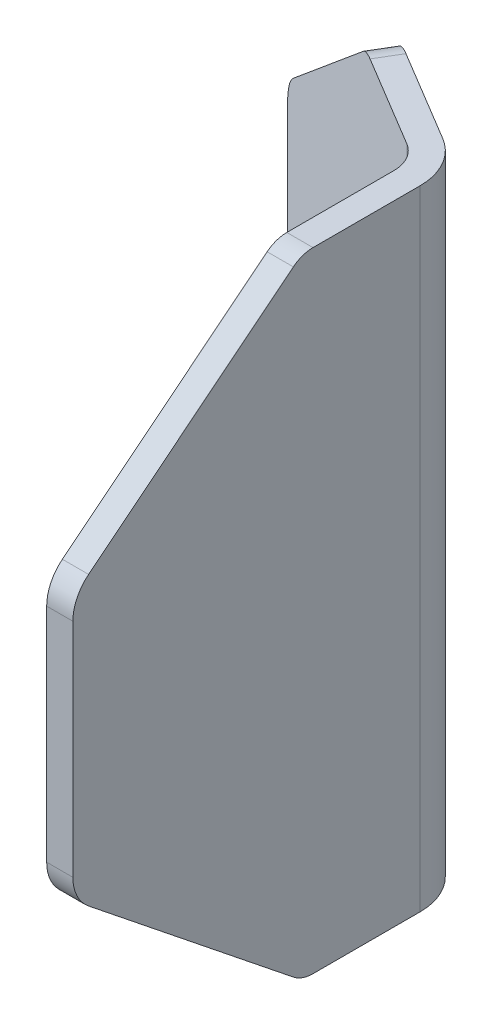
ISO-10303-21;
HEADER;
FILE_DESCRIPTION(('STEP AP214'),'2;1');
FILE_NAME('part.step','',(''),(''),'','','');
FILE_SCHEMA(('AUTOMOTIVE_DESIGN { 1 0 10303 214 1 1 1 1 }'));
ENDSEC;
DATA;
#1=APPLICATION_CONTEXT('core data for automotive mechanical design processes');
#2=APPLICATION_PROTOCOL_DEFINITION('international standard','automotive_design',2000,#1);
#3=PRODUCT_CONTEXT('',#1,'mechanical');
#4=PRODUCT('Part','Part','',(#3));
#5=PRODUCT_RELATED_PRODUCT_CATEGORY('part','',(#4));
#6=PRODUCT_DEFINITION_FORMATION('','',#4);
#7=PRODUCT_DEFINITION_CONTEXT('part definition',#1,'design');
#8=PRODUCT_DEFINITION('design','',#6,#7);
#9=PRODUCT_DEFINITION_SHAPE('','',#8);
#10=(LENGTH_UNIT() NAMED_UNIT(*) SI_UNIT(.MILLI.,.METRE.));
#11=(NAMED_UNIT(*) PLANE_ANGLE_UNIT() SI_UNIT($,.RADIAN.));
#12=(NAMED_UNIT(*) SI_UNIT($,.STERADIAN.) SOLID_ANGLE_UNIT());
#13=UNCERTAINTY_MEASURE_WITH_UNIT(LENGTH_MEASURE(1.E-05),#10,'distance_accuracy_value','');
#14=(GEOMETRIC_REPRESENTATION_CONTEXT(3) GLOBAL_UNCERTAINTY_ASSIGNED_CONTEXT((#13)) GLOBAL_UNIT_ASSIGNED_CONTEXT((#10,
#11,#12)) REPRESENTATION_CONTEXT('',''));
#15=CARTESIAN_POINT('',(0.,0.,0.));
#16=DIRECTION('',(0.,0.,1.));
#17=DIRECTION('',(1.,0.,0.));
#18=AXIS2_PLACEMENT_3D('',#15,#16,#17);
#19=CARTESIAN_POINT('',(-3.175,76.2,46.2534));
#20=DIRECTION('',(1.,0.,0.));
#21=DIRECTION('',(0.,0.,-1.));
#22=AXIS2_PLACEMENT_3D('',#19,#20,#21);
#23=PLANE('',#22);
#24=DIRECTION('',(0.,0.,1.));
#25=VECTOR('',#24,1.);
#26=CARTESIAN_POINT('',(-3.175,0.,46.2534));
#27=LINE('',#26,#25);
#28=CARTESIAN_POINT('',(-3.175,0.,4.17182452403423));
#29=VERTEX_POINT('',#28);
#30=CARTESIAN_POINT('',(-3.175,0.,17.1570723718987));
#31=VERTEX_POINT('',#30);
#32=EDGE_CURVE('E209',#29,#31,#27,.T.);
#33=ORIENTED_EDGE('',*,*,#32,.T.);
#34=CARTESIAN_POINT('',(-3.175,3.81,17.1570723718987));
#35=DIRECTION('',(1.,0.,0.));
#36=DIRECTION('',(0.,0.,-1.));
#37=AXIS2_PLACEMENT_3D('',#34,#35,#36);
#38=CIRCLE('',#37,3.81);
#39=CARTESIAN_POINT('',(-3.175,0.835819703262759,19.5383223718987));
#40=VERTEX_POINT('',#39);
#41=EDGE_CURVE('E289',#31,#40,#38,.F.);
#42=ORIENTED_EDGE('',*,*,#41,.T.);
#43=DIRECTION('',(0.,0.625,0.7806247497998));
#44=VECTOR('',#43,1.);
#45=CARTESIAN_POINT('',(-3.175,22.225,46.2534));
#46=LINE('',#45,#44);
#47=CARTESIAN_POINT('',(-3.175,20.6997793350065,44.3484));
#48=VERTEX_POINT('',#47);
#49=EDGE_CURVE('E352',#40,#48,#46,.T.);
#50=ORIENTED_EDGE('',*,*,#49,.T.);
#51=CARTESIAN_POINT('',(-3.175,24.6653530639895,41.1734));
#52=DIRECTION('',(1.,0.,0.));
#53=DIRECTION('',(0.,0.,-1.));
#54=AXIS2_PLACEMENT_3D('',#51,#52,#53);
#55=CIRCLE('',#54,5.08);
#56=CARTESIAN_POINT('',(-3.175,24.6653530639895,46.2534));
#57=VERTEX_POINT('',#56);
#58=EDGE_CURVE('E270',#48,#57,#55,.F.);
#59=ORIENTED_EDGE('',*,*,#58,.T.);
#60=DIRECTION('',(0.,-1.,0.));
#61=VECTOR('',#60,1.);
#62=CARTESIAN_POINT('',(-3.175,76.2,46.2534));
#63=LINE('',#62,#61);
#64=CARTESIAN_POINT('',(-3.175,51.5346469360105,46.2534));
#65=VERTEX_POINT('',#64);
#66=EDGE_CURVE('E229',#65,#57,#63,.T.);
#67=ORIENTED_EDGE('',*,*,#66,.F.);
#68=CARTESIAN_POINT('',(-3.175,51.5346469360105,41.1734));
#69=DIRECTION('',(1.,0.,0.));
#70=DIRECTION('',(0.,0.,-1.));
#71=AXIS2_PLACEMENT_3D('',#68,#69,#70);
#72=CIRCLE('',#71,5.08);
#73=CARTESIAN_POINT('',(-3.175,55.5002206649935,44.3484));
#74=VERTEX_POINT('',#73);
#75=EDGE_CURVE('E267',#65,#74,#72,.F.);
#76=ORIENTED_EDGE('',*,*,#75,.T.);
#77=DIRECTION('',(0.,-0.625000000000001,0.7806247497998));
#78=VECTOR('',#77,1.);
#79=CARTESIAN_POINT('',(-3.175,53.975,46.2534));
#80=LINE('',#79,#78);
#81=CARTESIAN_POINT('',(-3.175,75.3641802967372,19.5383223718987));
#82=VERTEX_POINT('',#81);
#83=EDGE_CURVE('E308',#82,#74,#80,.T.);
#84=ORIENTED_EDGE('',*,*,#83,.F.);
#85=CARTESIAN_POINT('',(-3.175,72.39,17.1570723718987));
#86=DIRECTION('',(1.,0.,0.));
#87=DIRECTION('',(0.,0.,-1.));
#88=AXIS2_PLACEMENT_3D('',#85,#86,#87);
#89=CIRCLE('',#88,3.81);
#90=CARTESIAN_POINT('',(-3.175,76.2,17.1570723718987));
#91=VERTEX_POINT('',#90);
#92=EDGE_CURVE('E287',#82,#91,#89,.F.);
#93=ORIENTED_EDGE('',*,*,#92,.T.);
#94=DIRECTION('',(0.,0.,1.));
#95=VECTOR('',#94,1.);
#96=CARTESIAN_POINT('',(-3.175,76.2,46.2534));
#97=LINE('',#96,#95);
#98=CARTESIAN_POINT('',(-3.175,76.2,4.17182452403423));
#99=VERTEX_POINT('',#98);
#100=EDGE_CURVE('E193',#99,#91,#97,.T.);
#101=ORIENTED_EDGE('',*,*,#100,.F.);
#102=DIRECTION('',(0.,-1.,0.));
#103=VECTOR('',#102,1.);
#104=CARTESIAN_POINT('',(-3.175,76.2,4.17182452403423));
#105=LINE('',#104,#103);
#106=EDGE_CURVE('E188',#99,#29,#105,.T.);
#107=ORIENTED_EDGE('',*,*,#106,.T.);
#108=EDGE_LOOP('',(#33,#42,#50,#59,#67,#76,#84,#93,#101,#107));
#109=FACE_BOUND('',#108,.T.);
#110=ADVANCED_FACE('F34',(#109),#23,.F.);
#111=CARTESIAN_POINT('',(-3.175,76.2,46.2534));
#112=DIRECTION('',(0.,0.,-1.));
#113=DIRECTION('',(-1.,0.,0.));
#114=AXIS2_PLACEMENT_3D('',#111,#112,#113);
#115=PLANE('',#114);
#116=ORIENTED_EDGE('',*,*,#66,.T.);
#117=DIRECTION('',(1.,0.,0.));
#118=VECTOR('',#117,1.);
#119=CARTESIAN_POINT('',(0.,24.6653530639895,46.2534));
#120=LINE('',#119,#118);
#121=CARTESIAN_POINT('',(0.,24.6653530639895,46.2534));
#122=VERTEX_POINT('',#121);
#123=EDGE_CURVE('E257',#57,#122,#120,.T.);
#124=ORIENTED_EDGE('',*,*,#123,.T.);
#125=DIRECTION('',(0.,-1.,0.));
#126=VECTOR('',#125,1.);
#127=CARTESIAN_POINT('',(0.,76.2,46.2534));
#128=LINE('',#127,#126);
#129=CARTESIAN_POINT('',(0.,51.5346469360105,46.2534));
#130=VERTEX_POINT('',#129);
#131=EDGE_CURVE('E226',#130,#122,#128,.T.);
#132=ORIENTED_EDGE('',*,*,#131,.F.);
#133=DIRECTION('',(1.,0.,0.));
#134=VECTOR('',#133,1.);
#135=CARTESIAN_POINT('',(-3.175,51.5346469360105,46.2534));
#136=LINE('',#135,#134);
#137=EDGE_CURVE('E255',#130,#65,#136,.F.);
#138=ORIENTED_EDGE('',*,*,#137,.T.);
#139=EDGE_LOOP('',(#116,#124,#132,#138));
#140=FACE_BOUND('',#139,.T.);
#141=ADVANCED_FACE('F364',(#140),#115,.F.);
#142=CARTESIAN_POINT('',(0.,76.2,46.2534));
#143=DIRECTION('',(-1.,0.,0.));
#144=DIRECTION('',(0.,0.,1.));
#145=AXIS2_PLACEMENT_3D('',#142,#143,#144);
#146=PLANE('',#145);
#147=DIRECTION('',(0.,-0.625,-0.7806247497998));
#148=VECTOR('',#147,1.);
#149=CARTESIAN_POINT('',(0.,22.225,46.2534));
#150=LINE('',#149,#148);
#151=CARTESIAN_POINT('',(0.,20.6997793350065,44.3484));
#152=VERTEX_POINT('',#151);
#153=CARTESIAN_POINT('',(0.,0.835819703262762,19.5383223718987));
#154=VERTEX_POINT('',#153);
#155=EDGE_CURVE('E207',#152,#154,#150,.T.);
#156=ORIENTED_EDGE('',*,*,#155,.T.);
#157=CARTESIAN_POINT('',(0.,3.81,17.1570723718987));
#158=DIRECTION('',(-1.,0.,0.));
#159=DIRECTION('',(0.,0.,1.));
#160=AXIS2_PLACEMENT_3D('',#157,#158,#159);
#161=CIRCLE('',#160,3.81);
#162=CARTESIAN_POINT('',(0.,0.,17.1570723718987));
#163=VERTEX_POINT('',#162);
#164=EDGE_CURVE('E280',#154,#163,#161,.F.);
#165=ORIENTED_EDGE('',*,*,#164,.T.);
#166=DIRECTION('',(0.,0.,-1.));
#167=VECTOR('',#166,1.);
#168=CARTESIAN_POINT('',(0.,0.,46.2534));
#169=LINE('',#168,#167);
#170=CARTESIAN_POINT('',(0.,0.,4.17182452403425));
#171=VERTEX_POINT('',#170);
#172=EDGE_CURVE('E212',#163,#171,#169,.T.);
#173=ORIENTED_EDGE('',*,*,#172,.T.);
#174=DIRECTION('',(0.,-1.,0.));
#175=VECTOR('',#174,1.);
#176=CARTESIAN_POINT('',(0.,76.2,4.17182452403425));
#177=LINE('',#176,#175);
#178=CARTESIAN_POINT('',(0.,76.2,4.17182452403425));
#179=VERTEX_POINT('',#178);
#180=EDGE_CURVE('E223',#179,#171,#177,.T.);
#181=ORIENTED_EDGE('',*,*,#180,.F.);
#182=DIRECTION('',(0.,0.,-1.));
#183=VECTOR('',#182,1.);
#184=CARTESIAN_POINT('',(0.,76.2,46.2534));
#185=LINE('',#184,#183);
#186=CARTESIAN_POINT('',(0.,76.2,17.1570723718987));
#187=VERTEX_POINT('',#186);
#188=EDGE_CURVE('E195',#187,#179,#185,.T.);
#189=ORIENTED_EDGE('',*,*,#188,.F.);
#190=CARTESIAN_POINT('',(0.,72.39,17.1570723718987));
#191=DIRECTION('',(-1.,0.,0.));
#192=DIRECTION('',(0.,0.,1.));
#193=AXIS2_PLACEMENT_3D('',#190,#191,#192);
#194=CIRCLE('',#193,3.81);
#195=CARTESIAN_POINT('',(0.,75.3641802967372,19.5383223718987));
#196=VERTEX_POINT('',#195);
#197=EDGE_CURVE('E278',#187,#196,#194,.F.);
#198=ORIENTED_EDGE('',*,*,#197,.T.);
#199=DIRECTION('',(0.,0.625000000000001,-0.780624749799799));
#200=VECTOR('',#199,1.);
#201=CARTESIAN_POINT('',(0.,53.975,46.2534));
#202=LINE('',#201,#200);
#203=CARTESIAN_POINT('',(0.,55.5002206649935,44.3484));
#204=VERTEX_POINT('',#203);
#205=EDGE_CURVE('E310',#204,#196,#202,.T.);
#206=ORIENTED_EDGE('',*,*,#205,.F.);
#207=CARTESIAN_POINT('',(0.,51.5346469360105,41.1734));
#208=DIRECTION('',(-1.,0.,0.));
#209=DIRECTION('',(0.,0.,1.));
#210=AXIS2_PLACEMENT_3D('',#207,#208,#209);
#211=CIRCLE('',#210,5.08);
#212=EDGE_CURVE('E260',#204,#130,#211,.F.);
#213=ORIENTED_EDGE('',*,*,#212,.T.);
#214=ORIENTED_EDGE('',*,*,#131,.T.);
#215=CARTESIAN_POINT('',(0.,24.6653530639895,41.1734));
#216=DIRECTION('',(-1.,0.,0.));
#217=DIRECTION('',(0.,0.,1.));
#218=AXIS2_PLACEMENT_3D('',#215,#216,#217);
#219=CIRCLE('',#218,5.08);
#220=EDGE_CURVE('E262',#122,#152,#219,.F.);
#221=ORIENTED_EDGE('',*,*,#220,.T.);
#222=EDGE_LOOP('',(#156,#165,#173,#181,#189,#198,#206,#213,#214,#221));
#223=FACE_BOUND('',#222,.T.);
#224=ADVANCED_FACE('F325',(#223),#146,.F.);
#225=CARTESIAN_POINT('',(-7.366,0.,4.17182452403421));
#226=DIRECTION('',(0.,-1.,0.));
#227=DIRECTION('',(0.,0.,-1.));
#228=AXIS2_PLACEMENT_3D('',#225,#226,#227);
#229=PLANE('',#228);
#230=ORIENTED_EDGE('',*,*,#172,.F.);
#231=DIRECTION('',(1.,0.,0.));
#232=VECTOR('',#231,1.);
#233=CARTESIAN_POINT('',(-7.366,0.,17.1570723718987));
#234=LINE('',#233,#232);
#235=EDGE_CURVE('E285',#163,#31,#234,.F.);
#236=ORIENTED_EDGE('',*,*,#235,.T.);
#237=ORIENTED_EDGE('',*,*,#32,.F.);
#238=CARTESIAN_POINT('',(-7.366,0.,4.17182452403421));
#239=DIRECTION('',(0.,-1.,0.));
#240=DIRECTION('',(0.,0.,-1.));
#241=AXIS2_PLACEMENT_3D('',#238,#239,#240);
#242=CIRCLE('',#241,4.191);
#243=CARTESIAN_POINT('',(-5.21068388037329,0.,0.577510483152802));
#244=VERTEX_POINT('',#243);
#245=EDGE_CURVE('E206',#244,#29,#242,.T.);
#246=ORIENTED_EDGE('',*,*,#245,.F.);
#247=DIRECTION('',(0.857626829129421,0.,0.514272517209909));
#248=VECTOR('',#247,1.);
#249=CARTESIAN_POINT('',(-41.3009720205962,0.,-21.0638872650309));
#250=LINE('',#249,#248);
#251=CARTESIAN_POINT('',(-16.3471808175969,0.,-6.100445614163));
#252=VERTEX_POINT('',#251);
#253=EDGE_CURVE('E184',#252,#244,#250,.T.);
#254=ORIENTED_EDGE('',*,*,#253,.F.);
#255=DIRECTION('',(0.514272517209909,0.,-0.85762682912942));
#256=VECTOR('',#255,1.);
#257=CARTESIAN_POINT('',(-14.7143655754555,0.,-8.82341079664892));
#258=LINE('',#257,#256);
#259=CARTESIAN_POINT('',(-14.7143655754555,0.,-8.82341079664891));
#260=VERTEX_POINT('',#259);
#261=EDGE_CURVE('E282',#252,#260,#258,.T.);
#262=ORIENTED_EDGE('',*,*,#261,.T.);
#263=DIRECTION('',(-0.857626829129421,0.,-0.514272517209909));
#264=VECTOR('',#263,1.);
#265=CARTESIAN_POINT('',(-39.6681567784547,0.,-23.7868524475168));
#266=LINE('',#265,#264);
#267=CARTESIAN_POINT('',(-3.57786863823183,0.,-2.1454546993331));
#268=VERTEX_POINT('',#267);
#269=EDGE_CURVE('E177',#268,#260,#266,.T.);
#270=ORIENTED_EDGE('',*,*,#269,.F.);
#271=CARTESIAN_POINT('',(-7.366,0.,4.17182452403421));
#272=DIRECTION('',(0.,1.,0.));
#273=DIRECTION('',(0.,0.,-1.));
#274=AXIS2_PLACEMENT_3D('',#271,#272,#273);
#275=CIRCLE('',#274,7.366);
#276=EDGE_CURVE('E214',#171,#268,#275,.T.);
#277=ORIENTED_EDGE('',*,*,#276,.F.);
#278=EDGE_LOOP('',(#230,#236,#237,#246,#254,#262,#270,#277));
#279=FACE_BOUND('',#278,.T.);
#280=ADVANCED_FACE('F396',(#279),#229,.T.);
#281=CARTESIAN_POINT('',(-39.6681567784547,76.2,-23.7868524475168));
#282=DIRECTION('',(0.85762682912942,0.,0.514272517209909));
#283=DIRECTION('',(0.514272517209909,0.,-0.85762682912942));
#284=AXIS2_PLACEMENT_3D('',#281,#282,#283);
#285=PLANE('',#284);
#286=DIRECTION('',(0.,-1.,0.));
#287=VECTOR('',#286,1.);
#288=CARTESIAN_POINT('',(-39.6681567784547,76.2,-23.7868524475168));
#289=LINE('',#288,#287);
#290=CARTESIAN_POINT('',(-39.6681567784547,51.5346469360105,-23.7868524475168));
#291=VERTEX_POINT('',#290);
#292=CARTESIAN_POINT('',(-39.6681567784547,24.6653530639895,-23.7868524475168));
#293=VERTEX_POINT('',#292);
#294=EDGE_CURVE('E204',#291,#293,#289,.T.);
#295=ORIENTED_EDGE('',*,*,#294,.T.);
#296=DIRECTION('',(0.514272517209909,0.,-0.85762682912942));
#297=VECTOR('',#296,1.);
#298=CARTESIAN_POINT('',(-39.6681567784547,24.6653530639895,-23.7868524475168));
#299=LINE('',#298,#297);
#300=CARTESIAN_POINT('',(-41.3009720205962,24.6653530639895,-21.0638872650309));
#301=VERTEX_POINT('',#300);
#302=EDGE_CURVE('E246',#293,#301,#299,.F.);
#303=ORIENTED_EDGE('',*,*,#302,.T.);
#304=DIRECTION('',(0.,-1.,0.));
#305=VECTOR('',#304,1.);
#306=CARTESIAN_POINT('',(-41.3009720205962,76.2,-21.0638872650309));
#307=LINE('',#306,#305);
#308=CARTESIAN_POINT('',(-41.3009720205962,51.5346469360105,-21.0638872650309));
#309=VERTEX_POINT('',#308);
#310=EDGE_CURVE('E187',#309,#301,#307,.T.);
#311=ORIENTED_EDGE('',*,*,#310,.F.);
#312=DIRECTION('',(0.514272517209909,0.,-0.85762682912942));
#313=VECTOR('',#312,1.);
#314=CARTESIAN_POINT('',(-39.6681567784547,51.5346469360105,-23.7868524475168));
#315=LINE('',#314,#313);
#316=EDGE_CURVE('E243',#309,#291,#315,.T.);
#317=ORIENTED_EDGE('',*,*,#316,.T.);
#318=EDGE_LOOP('',(#295,#303,#311,#317));
#319=FACE_BOUND('',#318,.T.);
#320=ADVANCED_FACE('F393',(#319),#285,.F.);
#321=CARTESIAN_POINT('',(-41.3009720205962,76.2,-21.0638872650309));
#322=DIRECTION('',(0.514272517209909,0.,-0.85762682912942));
#323=DIRECTION('',(-0.857626829129421,0.,-0.514272517209909));
#324=AXIS2_PLACEMENT_3D('',#321,#322,#323);
#325=PLANE('',#324);
#326=DIRECTION('',(-0.669484728910749,0.625,-0.401453855075898));
#327=VECTOR('',#326,1.);
#328=CARTESIAN_POINT('',(-17.49409506053,0.,-6.78818817853194));
#329=LINE('',#328,#327);
#330=CARTESIAN_POINT('',(-18.3894047044614,0.835819703262759,-7.3250570457691));
#331=VERTEX_POINT('',#330);
#332=CARTESIAN_POINT('',(-39.6671929111047,20.6997793350066,-20.084198119746));
#333=VERTEX_POINT('',#332);
#334=EDGE_CURVE('E317',#331,#333,#329,.T.);
#335=ORIENTED_EDGE('',*,*,#334,.F.);
#336=CARTESIAN_POINT('',(-16.3471808175969,3.81,-6.100445614163));
#337=DIRECTION('',(0.514272517209909,0.,-0.85762682912942));
#338=DIRECTION('',(-0.857626829129421,0.,-0.514272517209909));
#339=AXIS2_PLACEMENT_3D('',#336,#337,#338);
#340=CIRCLE('',#339,3.81);
#341=EDGE_CURVE('E298',#331,#252,#340,.F.);
#342=ORIENTED_EDGE('',*,*,#341,.T.);
#343=ORIENTED_EDGE('',*,*,#253,.T.);
#344=DIRECTION('',(0.,-1.,0.));
#345=VECTOR('',#344,1.);
#346=CARTESIAN_POINT('',(-5.21068388037329,76.2,0.577510483152802));
#347=LINE('',#346,#345);
#348=CARTESIAN_POINT('',(-5.21068388037329,76.2,0.577510483152802));
#349=VERTEX_POINT('',#348);
#350=EDGE_CURVE('E180',#349,#244,#347,.T.);
#351=ORIENTED_EDGE('',*,*,#350,.F.);
#352=DIRECTION('',(0.857626829129421,0.,0.514272517209909));
#353=VECTOR('',#352,1.);
#354=CARTESIAN_POINT('',(-41.3009720205962,76.2,-21.0638872650309));
#355=LINE('',#354,#353);
#356=CARTESIAN_POINT('',(-16.3471808175969,76.2,-6.100445614163));
#357=VERTEX_POINT('',#356);
#358=EDGE_CURVE('E170',#357,#349,#355,.T.);
#359=ORIENTED_EDGE('',*,*,#358,.F.);
#360=CARTESIAN_POINT('',(-16.3471808175969,72.39,-6.10044561416302));
#361=DIRECTION('',(0.514272517209909,0.,-0.85762682912942));
#362=DIRECTION('',(-0.857626829129421,0.,-0.514272517209909));
#363=AXIS2_PLACEMENT_3D('',#360,#361,#362);
#364=CIRCLE('',#363,3.81);
#365=CARTESIAN_POINT('',(-18.3894047044614,75.3641802967372,-7.3250570457691));
#366=VERTEX_POINT('',#365);
#367=EDGE_CURVE('E49',#357,#366,#364,.F.);
#368=ORIENTED_EDGE('',*,*,#367,.T.);
#369=DIRECTION('',(0.669484728910749,0.625,0.401453855075898));
#370=VECTOR('',#369,1.);
#371=CARTESIAN_POINT('',(-41.3009720205962,53.975,-21.0638872650309));
#372=LINE('',#371,#370);
#373=CARTESIAN_POINT('',(-39.6671929111046,55.5002206649935,-20.084198119746));
#374=VERTEX_POINT('',#373);
#375=EDGE_CURVE('E340',#374,#366,#372,.T.);
#376=ORIENTED_EDGE('',*,*,#375,.F.);
#377=CARTESIAN_POINT('',(-36.9442277286187,51.5346469360105,-18.4513828776045));
#378=DIRECTION('',(0.514272517209909,0.,-0.85762682912942));
#379=DIRECTION('',(-0.857626829129421,0.,-0.514272517209909));
#380=AXIS2_PLACEMENT_3D('',#377,#378,#379);
#381=CIRCLE('',#380,5.08);
#382=EDGE_CURVE('E248',#374,#309,#381,.F.);
#383=ORIENTED_EDGE('',*,*,#382,.T.);
#384=ORIENTED_EDGE('',*,*,#310,.T.);
#385=CARTESIAN_POINT('',(-36.9442277286187,24.6653530639895,-18.4513828776045));
#386=DIRECTION('',(0.514272517209909,0.,-0.85762682912942));
#387=DIRECTION('',(-0.857626829129421,0.,-0.514272517209909));
#388=AXIS2_PLACEMENT_3D('',#385,#386,#387);
#389=CIRCLE('',#388,5.08);
#390=EDGE_CURVE('E250',#301,#333,#389,.F.);
#391=ORIENTED_EDGE('',*,*,#390,.T.);
#392=EDGE_LOOP('',(#335,#342,#343,#351,#359,#368,#376,#383,#384,#391));
#393=FACE_BOUND('',#392,.T.);
#394=ADVANCED_FACE('F182',(#393),#325,.F.);
#395=CARTESIAN_POINT('',(-7.366,76.2,4.17182452403421));
#396=DIRECTION('',(0.,-1.,0.));
#397=DIRECTION('',(0.,0.,-1.));
#398=AXIS2_PLACEMENT_3D('',#395,#396,#397);
#399=CYLINDRICAL_SURFACE('',#398,4.191);
#400=ORIENTED_EDGE('',*,*,#245,.T.);
#401=ORIENTED_EDGE('',*,*,#106,.F.);
#402=CARTESIAN_POINT('',(-7.366,76.2,4.17182452403421));
#403=DIRECTION('',(0.,-1.,0.));
#404=DIRECTION('',(0.,0.,-1.));
#405=AXIS2_PLACEMENT_3D('',#402,#403,#404);
#406=CIRCLE('',#405,4.191);
#407=EDGE_CURVE('E175',#349,#99,#406,.T.);
#408=ORIENTED_EDGE('',*,*,#407,.F.);
#409=ORIENTED_EDGE('',*,*,#350,.T.);
#410=EDGE_LOOP('',(#400,#401,#408,#409));
#411=FACE_BOUND('',#410,.T.);
#412=ADVANCED_FACE('F190',(#411),#399,.F.);
#413=CARTESIAN_POINT('',(-7.366,76.2,4.17182452403421));
#414=DIRECTION('',(0.,-1.,0.));
#415=DIRECTION('',(0.,0.,-1.));
#416=AXIS2_PLACEMENT_3D('',#413,#414,#415);
#417=CYLINDRICAL_SURFACE('',#416,7.366);
#418=ORIENTED_EDGE('',*,*,#276,.T.);
#419=DIRECTION('',(0.,-1.,0.));
#420=VECTOR('',#419,1.);
#421=CARTESIAN_POINT('',(-3.57786863823183,76.2,-2.1454546993331));
#422=LINE('',#421,#420);
#423=CARTESIAN_POINT('',(-3.57786863823183,76.2,-2.1454546993331));
#424=VERTEX_POINT('',#423);
#425=EDGE_CURVE('E220',#424,#268,#422,.T.);
#426=ORIENTED_EDGE('',*,*,#425,.F.);
#427=CARTESIAN_POINT('',(-7.366,76.2,4.17182452403421));
#428=DIRECTION('',(0.,1.,0.));
#429=DIRECTION('',(0.,0.,-1.));
#430=AXIS2_PLACEMENT_3D('',#427,#428,#429);
#431=CIRCLE('',#430,7.366);
#432=EDGE_CURVE('E200',#179,#424,#431,.T.);
#433=ORIENTED_EDGE('',*,*,#432,.F.);
#434=ORIENTED_EDGE('',*,*,#180,.T.);
#435=EDGE_LOOP('',(#418,#426,#433,#434));
#436=FACE_BOUND('',#435,.T.);
#437=ADVANCED_FACE('F331',(#436),#417,.T.);
#438=CARTESIAN_POINT('',(-39.6681567784547,76.2,-23.7868524475168));
#439=DIRECTION('',(-0.514272517209909,0.,0.85762682912942));
#440=DIRECTION('',(0.857626829129421,0.,0.514272517209909));
#441=AXIS2_PLACEMENT_3D('',#438,#439,#440);
#442=PLANE('',#441);
#443=ORIENTED_EDGE('',*,*,#269,.T.);
#444=CARTESIAN_POINT('',(-14.7143655754555,3.81,-8.82341079664891));
#445=DIRECTION('',(-0.514272517209909,0.,0.85762682912942));
#446=DIRECTION('',(0.857626829129421,0.,0.514272517209909));
#447=AXIS2_PLACEMENT_3D('',#444,#445,#446);
#448=CIRCLE('',#447,3.81);
#449=CARTESIAN_POINT('',(-16.7565894623199,0.835819703262759,-10.048022228255));
#450=VERTEX_POINT('',#449);
#451=EDGE_CURVE('E293',#260,#450,#448,.F.);
#452=ORIENTED_EDGE('',*,*,#451,.T.);
#453=DIRECTION('',(0.669484728910749,-0.625,0.401453855075898));
#454=VECTOR('',#453,1.);
#455=CARTESIAN_POINT('',(-15.8612798183885,0.,-9.51115336101785));
#456=LINE('',#455,#454);
#457=CARTESIAN_POINT('',(-38.0343776689632,20.6997793350066,-22.8071633022319));
#458=VERTEX_POINT('',#457);
#459=EDGE_CURVE('E344',#458,#450,#456,.T.);
#460=ORIENTED_EDGE('',*,*,#459,.F.);
#461=CARTESIAN_POINT('',(-35.3114124864773,24.6653530639895,-21.1743480600904));
#462=DIRECTION('',(-0.514272517209909,0.,0.85762682912942));
#463=DIRECTION('',(0.857626829129421,0.,0.514272517209909));
#464=AXIS2_PLACEMENT_3D('',#461,#462,#463);
#465=CIRCLE('',#464,5.08);
#466=EDGE_CURVE('E241',#458,#293,#465,.F.);
#467=ORIENTED_EDGE('',*,*,#466,.T.);
#468=ORIENTED_EDGE('',*,*,#294,.F.);
#469=CARTESIAN_POINT('',(-35.3114124864773,51.5346469360105,-21.1743480600904));
#470=DIRECTION('',(-0.514272517209909,0.,0.85762682912942));
#471=DIRECTION('',(0.857626829129421,0.,0.514272517209909));
#472=AXIS2_PLACEMENT_3D('',#469,#470,#471);
#473=CIRCLE('',#472,5.08);
#474=CARTESIAN_POINT('',(-38.0343776689632,55.5002206649935,-22.8071633022319));
#475=VERTEX_POINT('',#474);
#476=EDGE_CURVE('E238',#291,#475,#473,.F.);
#477=ORIENTED_EDGE('',*,*,#476,.T.);
#478=DIRECTION('',(-0.669484728910749,-0.625,-0.401453855075898));
#479=VECTOR('',#478,1.);
#480=CARTESIAN_POINT('',(-39.6681567784547,53.975,-23.7868524475168));
#481=LINE('',#480,#479);
#482=CARTESIAN_POINT('',(-16.7565894623199,75.3641802967372,-10.048022228255));
#483=VERTEX_POINT('',#482);
#484=EDGE_CURVE('E339',#483,#475,#481,.T.);
#485=ORIENTED_EDGE('',*,*,#484,.F.);
#486=CARTESIAN_POINT('',(-14.7143655754555,72.39,-8.82341079664892));
#487=DIRECTION('',(-0.514272517209909,0.,0.85762682912942));
#488=DIRECTION('',(0.857626829129421,0.,0.514272517209909));
#489=AXIS2_PLACEMENT_3D('',#486,#487,#488);
#490=CIRCLE('',#489,3.81);
#491=CARTESIAN_POINT('',(-14.7143655754555,76.2,-8.82341079664891));
#492=VERTEX_POINT('',#491);
#493=EDGE_CURVE('E291',#483,#492,#490,.F.);
#494=ORIENTED_EDGE('',*,*,#493,.T.);
#495=DIRECTION('',(-0.857626829129421,0.,-0.514272517209909));
#496=VECTOR('',#495,1.);
#497=CARTESIAN_POINT('',(-39.6681567784547,76.2,-23.7868524475168));
#498=LINE('',#497,#496);
#499=EDGE_CURVE('E202',#424,#492,#498,.T.);
#500=ORIENTED_EDGE('',*,*,#499,.F.);
#501=ORIENTED_EDGE('',*,*,#425,.T.);
#502=EDGE_LOOP('',(#443,#452,#460,#467,#468,#477,#485,#494,#500,#501));
#503=FACE_BOUND('',#502,.T.);
#504=ADVANCED_FACE('F341',(#503),#442,.F.);
#505=CARTESIAN_POINT('',(-7.366,76.2,4.17182452403421));
#506=DIRECTION('',(0.,-1.,0.));
#507=DIRECTION('',(0.,0.,-1.));
#508=AXIS2_PLACEMENT_3D('',#505,#506,#507);
#509=PLANE('',#508);
#510=ORIENTED_EDGE('',*,*,#100,.T.);
#511=DIRECTION('',(1.,0.,0.));
#512=VECTOR('',#511,1.);
#513=CARTESIAN_POINT('',(-7.366,76.2,17.1570723718987));
#514=LINE('',#513,#512);
#515=EDGE_CURVE('E301',#91,#187,#514,.T.);
#516=ORIENTED_EDGE('',*,*,#515,.T.);
#517=ORIENTED_EDGE('',*,*,#188,.T.);
#518=ORIENTED_EDGE('',*,*,#432,.T.);
#519=ORIENTED_EDGE('',*,*,#499,.T.);
#520=DIRECTION('',(0.514272517209909,0.,-0.85762682912942));
#521=VECTOR('',#520,1.);
#522=CARTESIAN_POINT('',(-18.5024969372237,76.2,-2.50613157328161));
#523=LINE('',#522,#521);
#524=EDGE_CURVE('E57',#492,#357,#523,.F.);
#525=ORIENTED_EDGE('',*,*,#524,.T.);
#526=ORIENTED_EDGE('',*,*,#358,.T.);
#527=ORIENTED_EDGE('',*,*,#407,.T.);
#528=EDGE_LOOP('',(#510,#516,#517,#518,#519,#525,#526,#527));
#529=FACE_BOUND('',#528,.T.);
#530=ADVANCED_FACE('F173',(#529),#509,.F.);
#531=CARTESIAN_POINT('',(-41.3019720205962,22.225,46.2534));
#532=DIRECTION('',(0.,-0.7806247497998,0.625));
#533=DIRECTION('',(0.,-0.625,-0.7806247497998));
#534=AXIS2_PLACEMENT_3D('',#531,#532,#533);
#535=PLANE('',#534);
#536=ORIENTED_EDGE('',*,*,#49,.F.);
#537=DIRECTION('',(1.,0.,0.));
#538=VECTOR('',#537,1.);
#539=CARTESIAN_POINT('',(-41.3019720205962,0.835819703262766,19.5383223718987));
#540=LINE('',#539,#538);
#541=EDGE_CURVE('E275',#40,#154,#540,.T.);
#542=ORIENTED_EDGE('',*,*,#541,.T.);
#543=ORIENTED_EDGE('',*,*,#155,.F.);
#544=DIRECTION('',(1.,0.,0.));
#545=VECTOR('',#544,1.);
#546=CARTESIAN_POINT('',(-3.175,20.6997793350065,44.3484));
#547=LINE('',#546,#545);
#548=EDGE_CURVE('E264',#152,#48,#547,.F.);
#549=ORIENTED_EDGE('',*,*,#548,.T.);
#550=EDGE_LOOP('',(#536,#542,#543,#549));
#551=FACE_BOUND('',#550,.T.);
#552=ADVANCED_FACE('F357',(#551),#535,.T.);
#553=CARTESIAN_POINT('',(-41.3019720205962,53.975,46.2534));
#554=DIRECTION('',(0.,-0.780624749799799,-0.625000000000001));
#555=DIRECTION('',(0.,0.625000000000001,-0.780624749799799));
#556=AXIS2_PLACEMENT_3D('',#553,#554,#555);
#557=PLANE('',#556);
#558=ORIENTED_EDGE('',*,*,#205,.T.);
#559=DIRECTION('',(1.,0.,0.));
#560=VECTOR('',#559,1.);
#561=CARTESIAN_POINT('',(-41.3019720205962,75.3641802967372,19.5383223718987));
#562=LINE('',#561,#560);
#563=EDGE_CURVE('E42',#196,#82,#562,.F.);
#564=ORIENTED_EDGE('',*,*,#563,.T.);
#565=ORIENTED_EDGE('',*,*,#83,.T.);
#566=DIRECTION('',(1.,0.,0.));
#567=VECTOR('',#566,1.);
#568=CARTESIAN_POINT('',(-41.3019720205962,55.5002206649935,44.3484));
#569=LINE('',#568,#567);
#570=EDGE_CURVE('E272',#74,#204,#569,.T.);
#571=ORIENTED_EDGE('',*,*,#570,.T.);
#572=EDGE_LOOP('',(#558,#564,#565,#571));
#573=FACE_BOUND('',#572,.T.);
#574=ADVANCED_FACE('F307',(#573),#557,.F.);
#575=CARTESIAN_POINT('',(-47.1853532312281,0.,42.7264538559078));
#576=DIRECTION('',(0.536016768205888,0.7806247497998,0.321420323256193));
#577=DIRECTION('',(-0.82436852418182,0.566053474804534,0.));
#578=AXIS2_PLACEMENT_3D('',#575,#576,#577);
#579=PLANE('',#578);
#580=ORIENTED_EDGE('',*,*,#459,.T.);
#581=DIRECTION('',(0.514272517209909,0.,-0.85762682912942));
#582=VECTOR('',#581,1.);
#583=CARTESIAN_POINT('',(-18.3894047044614,0.835819703262759,-7.3250570457691));
#584=LINE('',#583,#582);
#585=EDGE_CURVE('E295',#450,#331,#584,.F.);
#586=ORIENTED_EDGE('',*,*,#585,.T.);
#587=ORIENTED_EDGE('',*,*,#334,.T.);
#588=DIRECTION('',(0.514272517209909,0.,-0.85762682912942));
#589=VECTOR('',#588,1.);
#590=CARTESIAN_POINT('',(-69.3584510818029,20.6997793350066,29.4304439146937));
#591=LINE('',#590,#589);
#592=EDGE_CURVE('E235',#333,#458,#591,.T.);
#593=ORIENTED_EDGE('',*,*,#592,.T.);
#594=EDGE_LOOP('',(#580,#586,#587,#593));
#595=FACE_BOUND('',#594,.T.);
#596=ADVANCED_FACE('F420',(#595),#579,.F.);
#597=CARTESIAN_POINT('',(-70.9922301912944,53.975,28.4507547694088));
#598=DIRECTION('',(0.536016768205888,-0.7806247497998,0.321420323256193));
#599=DIRECTION('',(0.82436852418182,0.566053474804534,0.));
#600=AXIS2_PLACEMENT_3D('',#597,#598,#599);
#601=PLANE('',#600);
#602=ORIENTED_EDGE('',*,*,#375,.T.);
#603=DIRECTION('',(0.514272517209909,0.,-0.85762682912942));
#604=VECTOR('',#603,1.);
#605=CARTESIAN_POINT('',(-48.0806628751596,75.3641802967372,42.1895849886706));
#606=LINE('',#605,#604);
#607=EDGE_CURVE('E11',#366,#483,#606,.T.);
#608=ORIENTED_EDGE('',*,*,#607,.T.);
#609=ORIENTED_EDGE('',*,*,#484,.T.);
#610=DIRECTION('',(0.514272517209909,0.,-0.85762682912942));
#611=VECTOR('',#610,1.);
#612=CARTESIAN_POINT('',(-69.3584510818029,55.5002206649934,29.4304439146937));
#613=LINE('',#612,#611);
#614=EDGE_CURVE('E253',#475,#374,#613,.F.);
#615=ORIENTED_EDGE('',*,*,#614,.T.);
#616=EDGE_LOOP('',(#602,#608,#609,#615));
#617=FACE_BOUND('',#616,.T.);
#618=ADVANCED_FACE('F338',(#617),#601,.F.);
#619=CARTESIAN_POINT('',(-66.6354858993169,24.6653530639896,31.0632591568351));
#620=DIRECTION('',(0.514272517209909,0.,-0.85762682912942));
#621=DIRECTION('',(-0.85762682912942,0.,-0.514272517209909));
#622=AXIS2_PLACEMENT_3D('',#619,#620,#621);
#623=CYLINDRICAL_SURFACE('',#622,5.08);
#624=ORIENTED_EDGE('',*,*,#390,.F.);
#625=ORIENTED_EDGE('',*,*,#302,.F.);
#626=ORIENTED_EDGE('',*,*,#466,.F.);
#627=ORIENTED_EDGE('',*,*,#592,.F.);
#628=EDGE_LOOP('',(#624,#625,#626,#627));
#629=FACE_BOUND('',#628,.T.);
#630=ADVANCED_FACE('F398',(#629),#623,.T.);
#631=CARTESIAN_POINT('',(-35.3114124864773,51.5346469360105,-21.1743480600905));
#632=DIRECTION('',(0.514272517209909,0.,-0.85762682912942));
#633=DIRECTION('',(-0.85762682912942,0.,-0.514272517209909));
#634=AXIS2_PLACEMENT_3D('',#631,#632,#633);
#635=CYLINDRICAL_SURFACE('',#634,5.08);
#636=ORIENTED_EDGE('',*,*,#382,.F.);
#637=ORIENTED_EDGE('',*,*,#614,.F.);
#638=ORIENTED_EDGE('',*,*,#476,.F.);
#639=ORIENTED_EDGE('',*,*,#316,.F.);
#640=EDGE_LOOP('',(#636,#637,#638,#639));
#641=FACE_BOUND('',#640,.T.);
#642=ADVANCED_FACE('F379',(#641),#635,.T.);
#643=CARTESIAN_POINT('',(-3.175,24.6653530639895,41.1734));
#644=DIRECTION('',(-1.,0.,0.));
#645=DIRECTION('',(0.,0.,1.));
#646=AXIS2_PLACEMENT_3D('',#643,#644,#645);
#647=CYLINDRICAL_SURFACE('',#646,5.08);
#648=ORIENTED_EDGE('',*,*,#58,.F.);
#649=ORIENTED_EDGE('',*,*,#548,.F.);
#650=ORIENTED_EDGE('',*,*,#220,.F.);
#651=ORIENTED_EDGE('',*,*,#123,.F.);
#652=EDGE_LOOP('',(#648,#649,#650,#651));
#653=FACE_BOUND('',#652,.T.);
#654=ADVANCED_FACE('F361',(#653),#647,.T.);
#655=CARTESIAN_POINT('',(-41.3019720205962,51.5346469360105,41.1734));
#656=DIRECTION('',(1.,0.,0.));
#657=DIRECTION('',(0.,0.,-1.));
#658=AXIS2_PLACEMENT_3D('',#655,#656,#657);
#659=CYLINDRICAL_SURFACE('',#658,5.08);
#660=ORIENTED_EDGE('',*,*,#75,.F.);
#661=ORIENTED_EDGE('',*,*,#137,.F.);
#662=ORIENTED_EDGE('',*,*,#212,.F.);
#663=ORIENTED_EDGE('',*,*,#570,.F.);
#664=EDGE_LOOP('',(#660,#661,#662,#663));
#665=FACE_BOUND('',#664,.T.);
#666=ADVANCED_FACE('F368',(#665),#659,.T.);
#667=CARTESIAN_POINT('',(-41.3019720205962,3.81,17.1570723718987));
#668=DIRECTION('',(1.,0.,0.));
#669=DIRECTION('',(0.,0.,-1.));
#670=AXIS2_PLACEMENT_3D('',#667,#668,#669);
#671=CYLINDRICAL_SURFACE('',#670,3.81);
#672=ORIENTED_EDGE('',*,*,#41,.F.);
#673=ORIENTED_EDGE('',*,*,#235,.F.);
#674=ORIENTED_EDGE('',*,*,#164,.F.);
#675=ORIENTED_EDGE('',*,*,#541,.F.);
#676=EDGE_LOOP('',(#672,#673,#674,#675));
#677=FACE_BOUND('',#676,.T.);
#678=ADVANCED_FACE('F370',(#677),#671,.T.);
#679=CARTESIAN_POINT('',(-18.5024969372237,3.81,-2.50613157328161));
#680=DIRECTION('',(-0.514272517209909,0.,0.85762682912942));
#681=DIRECTION('',(0.85762682912942,0.,0.514272517209909));
#682=AXIS2_PLACEMENT_3D('',#679,#680,#681);
#683=CYLINDRICAL_SURFACE('',#682,3.81);
#684=ORIENTED_EDGE('',*,*,#341,.F.);
#685=ORIENTED_EDGE('',*,*,#585,.F.);
#686=ORIENTED_EDGE('',*,*,#451,.F.);
#687=ORIENTED_EDGE('',*,*,#261,.F.);
#688=EDGE_LOOP('',(#684,#685,#686,#687));
#689=FACE_BOUND('',#688,.T.);
#690=ADVANCED_FACE('F376',(#689),#683,.T.);
#691=CARTESIAN_POINT('',(-7.366,72.39,17.1570723718987));
#692=DIRECTION('',(1.,0.,0.));
#693=DIRECTION('',(0.,0.,-1.));
#694=AXIS2_PLACEMENT_3D('',#691,#692,#693);
#695=CYLINDRICAL_SURFACE('',#694,3.81);
#696=ORIENTED_EDGE('',*,*,#92,.F.);
#697=ORIENTED_EDGE('',*,*,#563,.F.);
#698=ORIENTED_EDGE('',*,*,#197,.F.);
#699=ORIENTED_EDGE('',*,*,#515,.F.);
#700=EDGE_LOOP('',(#696,#697,#698,#699));
#701=FACE_BOUND('',#700,.T.);
#702=ADVANCED_FACE('F320',(#701),#695,.T.);
#703=CARTESIAN_POINT('',(-46.0384389882951,72.39,43.4141964202767));
#704=DIRECTION('',(0.514272517209909,0.,-0.85762682912942));
#705=DIRECTION('',(-0.85762682912942,0.,-0.514272517209909));
#706=AXIS2_PLACEMENT_3D('',#703,#704,#705);
#707=CYLINDRICAL_SURFACE('',#706,3.81);
#708=ORIENTED_EDGE('',*,*,#367,.F.);
#709=ORIENTED_EDGE('',*,*,#524,.F.);
#710=ORIENTED_EDGE('',*,*,#493,.F.);
#711=ORIENTED_EDGE('',*,*,#607,.F.);
#712=EDGE_LOOP('',(#708,#709,#710,#711));
#713=FACE_BOUND('',#712,.T.);
#714=ADVANCED_FACE('F36',(#713),#707,.T.);
#715=CLOSED_SHELL('',(#110,#141,#224,#280,#320,#394,#412,#437,#504,#530,#552,#574,#596,#618,
#630,#642,#654,#666,#678,#690,#702,#714));
#716=MANIFOLD_SOLID_BREP('B2',#715);
#717=ADVANCED_BREP_SHAPE_REPRESENTATION('',(#18,#716),#14);
#718=SHAPE_DEFINITION_REPRESENTATION(#9,#717);
ENDSEC;
END-ISO-10303-21;
